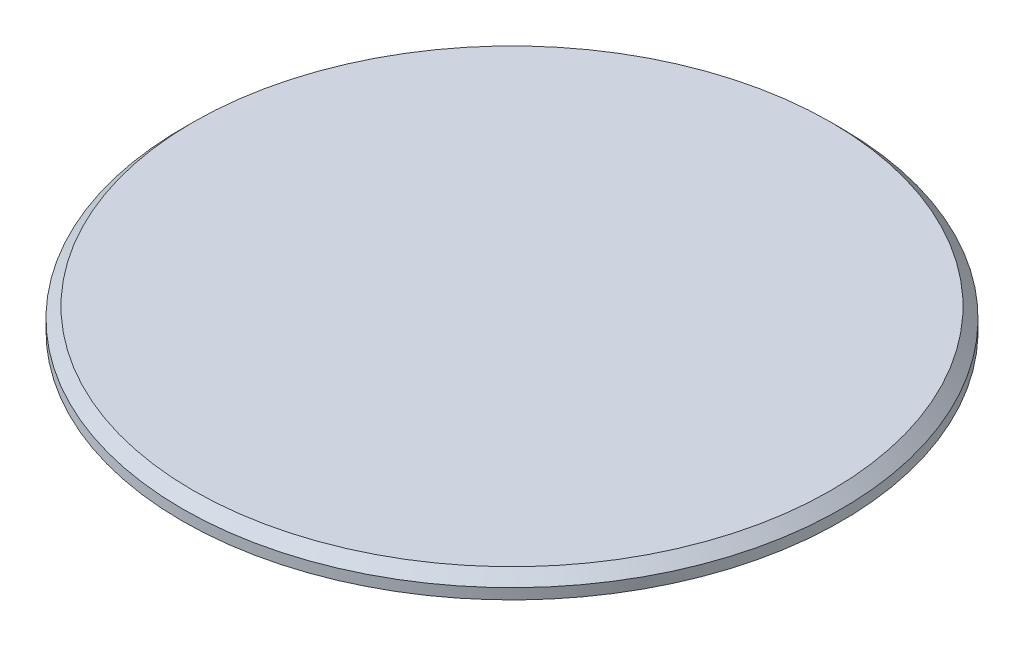
ISO-10303-21;
HEADER;
FILE_DESCRIPTION(('STEP AP214'),'2;1');
FILE_NAME('part.step','',(''),(''),'','','');
FILE_SCHEMA(('AUTOMOTIVE_DESIGN { 1 0 10303 214 1 1 1 1 }'));
ENDSEC;
DATA;
#1=APPLICATION_CONTEXT('core data for automotive mechanical design processes');
#2=APPLICATION_PROTOCOL_DEFINITION('international standard','automotive_design',2000,#1);
#3=PRODUCT_CONTEXT('',#1,'mechanical');
#4=PRODUCT('Part','Part','',(#3));
#5=PRODUCT_RELATED_PRODUCT_CATEGORY('part','',(#4));
#6=PRODUCT_DEFINITION_FORMATION('','',#4);
#7=PRODUCT_DEFINITION_CONTEXT('part definition',#1,'design');
#8=PRODUCT_DEFINITION('design','',#6,#7);
#9=PRODUCT_DEFINITION_SHAPE('','',#8);
#10=(LENGTH_UNIT() NAMED_UNIT(*) SI_UNIT(.MILLI.,.METRE.));
#11=(NAMED_UNIT(*) PLANE_ANGLE_UNIT() SI_UNIT($,.RADIAN.));
#12=(NAMED_UNIT(*) SI_UNIT($,.STERADIAN.) SOLID_ANGLE_UNIT());
#13=UNCERTAINTY_MEASURE_WITH_UNIT(LENGTH_MEASURE(1.E-05),#10,'distance_accuracy_value','');
#14=(GEOMETRIC_REPRESENTATION_CONTEXT(3) GLOBAL_UNCERTAINTY_ASSIGNED_CONTEXT((#13)) GLOBAL_UNIT_ASSIGNED_CONTEXT((#10,
#11,#12)) REPRESENTATION_CONTEXT('',''));
#15=CARTESIAN_POINT('',(0.,0.,0.));
#16=DIRECTION('',(0.,0.,1.));
#17=DIRECTION('',(1.,0.,0.));
#18=AXIS2_PLACEMENT_3D('',#15,#16,#17);
#19=CARTESIAN_POINT('',(0.,7.,0.));
#20=DIRECTION('',(0.,-1.,0.));
#21=DIRECTION('',(0.,0.,-1.));
#22=AXIS2_PLACEMENT_3D('',#19,#20,#21);
#23=CYLINDRICAL_SURFACE('',#22,17.35);
#24=CARTESIAN_POINT('',(0.,7.,0.));
#25=DIRECTION('',(0.,1.,0.));
#26=DIRECTION('',(0.,0.,1.));
#27=AXIS2_PLACEMENT_3D('',#24,#25,#26);
#28=CIRCLE('',#27,17.35);
#29=CARTESIAN_POINT('',(0.,7.,17.35));
#30=VERTEX_POINT('',#29);
#31=EDGE_CURVE('E42',#30,#30,#28,.T.);
#32=ORIENTED_EDGE('',*,*,#31,.F.);
#33=EDGE_LOOP('',(#32));
#34=FACE_BOUND('',#33,.T.);
#35=CARTESIAN_POINT('',(0.,0.,0.));
#36=DIRECTION('',(0.,1.,0.));
#37=DIRECTION('',(0.,0.,1.));
#38=AXIS2_PLACEMENT_3D('',#35,#36,#37);
#39=CIRCLE('',#38,17.35);
#40=CARTESIAN_POINT('',(0.,0.,17.35));
#41=VERTEX_POINT('',#40);
#42=EDGE_CURVE('E46',#41,#41,#39,.T.);
#43=ORIENTED_EDGE('',*,*,#42,.T.);
#44=EDGE_LOOP('',(#43));
#45=FACE_BOUND('',#44,.T.);
#46=ADVANCED_FACE('F31',(#34,#45),#23,.T.);
#47=CARTESIAN_POINT('',(0.,0.,0.));
#48=DIRECTION('',(0.,1.,0.));
#49=DIRECTION('',(0.,0.,1.));
#50=AXIS2_PLACEMENT_3D('',#47,#48,#49);
#51=PLANE('',#50);
#52=CARTESIAN_POINT('',(0.,0.,0.));
#53=DIRECTION('',(0.,-1.,0.));
#54=DIRECTION('',(0.,0.,-1.));
#55=AXIS2_PLACEMENT_3D('',#52,#53,#54);
#56=CIRCLE('',#55,14.6466926588485);
#57=CARTESIAN_POINT('',(0.,0.,-14.6466926588485));
#58=VERTEX_POINT('',#57);
#59=EDGE_CURVE('E55',#58,#58,#56,.T.);
#60=ORIENTED_EDGE('',*,*,#59,.F.);
#61=EDGE_LOOP('',(#60));
#62=FACE_BOUND('',#61,.T.);
#63=ORIENTED_EDGE('',*,*,#42,.F.);
#64=EDGE_LOOP('',(#63));
#65=FACE_BOUND('',#64,.T.);
#66=ADVANCED_FACE('F70',(#62,#65),#51,.F.);
#67=CARTESIAN_POINT('',(0.,7.,0.));
#68=DIRECTION('',(0.,1.,0.));
#69=DIRECTION('',(0.,0.,1.));
#70=AXIS2_PLACEMENT_3D('',#67,#68,#69);
#71=PLANE('',#70);
#72=CARTESIAN_POINT('',(0.,7.,0.));
#73=DIRECTION('',(0.,1.,0.));
#74=DIRECTION('',(0.,0.,1.));
#75=AXIS2_PLACEMENT_3D('',#72,#73,#74);
#76=CIRCLE('',#75,31.);
#77=CARTESIAN_POINT('',(0.,7.,31.));
#78=VERTEX_POINT('',#77);
#79=EDGE_CURVE('E50',#78,#78,#76,.T.);
#80=ORIENTED_EDGE('',*,*,#79,.F.);
#81=EDGE_LOOP('',(#80));
#82=FACE_BOUND('',#81,.T.);
#83=ORIENTED_EDGE('',*,*,#31,.T.);
#84=EDGE_LOOP('',(#83));
#85=FACE_BOUND('',#84,.T.);
#86=ADVANCED_FACE('F73',(#82,#85),#71,.F.);
#87=CARTESIAN_POINT('',(0.,9.,0.));
#88=DIRECTION('',(0.,-1.,0.));
#89=DIRECTION('',(0.,0.,-1.));
#90=AXIS2_PLACEMENT_3D('',#87,#88,#89);
#91=CYLINDRICAL_SURFACE('',#90,31.);
#92=CARTESIAN_POINT('',(0.,8.,0.));
#93=DIRECTION('',(0.,1.,0.));
#94=DIRECTION('',(0.,0.,1.));
#95=AXIS2_PLACEMENT_3D('',#92,#93,#94);
#96=CIRCLE('',#95,31.);
#97=CARTESIAN_POINT('',(0.,8.,31.));
#98=VERTEX_POINT('',#97);
#99=EDGE_CURVE('E10',#98,#98,#96,.F.);
#100=ORIENTED_EDGE('',*,*,#99,.T.);
#101=EDGE_LOOP('',(#100));
#102=FACE_BOUND('',#101,.T.);
#103=ORIENTED_EDGE('',*,*,#79,.T.);
#104=EDGE_LOOP('',(#103));
#105=FACE_BOUND('',#104,.T.);
#106=ADVANCED_FACE('F83',(#102,#105),#91,.T.);
#107=CARTESIAN_POINT('',(0.,9.,0.));
#108=DIRECTION('',(0.,1.,0.));
#109=DIRECTION('',(0.,0.,1.));
#110=AXIS2_PLACEMENT_3D('',#107,#108,#109);
#111=PLANE('',#110);
#112=CARTESIAN_POINT('',(0.,9.,0.));
#113=DIRECTION('',(0.,1.,0.));
#114=DIRECTION('',(0.,0.,1.));
#115=AXIS2_PLACEMENT_3D('',#112,#113,#114);
#116=CIRCLE('',#115,30.);
#117=CARTESIAN_POINT('',(0.,9.,30.));
#118=VERTEX_POINT('',#117);
#119=EDGE_CURVE('E38',#118,#118,#116,.T.);
#120=ORIENTED_EDGE('',*,*,#119,.T.);
#121=EDGE_LOOP('',(#120));
#122=FACE_BOUND('',#121,.T.);
#123=ADVANCED_FACE('F66',(#122),#111,.T.);
#124=CARTESIAN_POINT('',(0.,7.,0.));
#125=DIRECTION('',(0.,-1.,0.));
#126=DIRECTION('',(0.,0.,-1.));
#127=AXIS2_PLACEMENT_3D('',#124,#125,#126);
#128=CYLINDRICAL_SURFACE('',#127,14.6466926588485);
#129=CARTESIAN_POINT('',(0.,7.,0.));
#130=DIRECTION('',(0.,-1.,0.));
#131=DIRECTION('',(0.,0.,-1.));
#132=AXIS2_PLACEMENT_3D('',#129,#130,#131);
#133=CIRCLE('',#132,14.6466926588485);
#134=CARTESIAN_POINT('',(0.,7.,-14.6466926588485));
#135=VERTEX_POINT('',#134);
#136=EDGE_CURVE('E54',#135,#135,#133,.T.);
#137=ORIENTED_EDGE('',*,*,#136,.F.);
#138=EDGE_LOOP('',(#137));
#139=FACE_BOUND('',#138,.T.);
#140=ORIENTED_EDGE('',*,*,#59,.T.);
#141=EDGE_LOOP('',(#140));
#142=FACE_BOUND('',#141,.T.);
#143=ADVANCED_FACE('F63',(#139,#142),#128,.F.);
#144=CARTESIAN_POINT('',(0.,7.,0.));
#145=DIRECTION('',(0.,-1.,0.));
#146=DIRECTION('',(0.,0.,-1.));
#147=AXIS2_PLACEMENT_3D('',#144,#145,#146);
#148=PLANE('',#147);
#149=ORIENTED_EDGE('',*,*,#136,.T.);
#150=EDGE_LOOP('',(#149));
#151=FACE_BOUND('',#150,.T.);
#152=ADVANCED_FACE('F61',(#151),#148,.T.);
#153=CARTESIAN_POINT('',(0.,9.,0.));
#154=DIRECTION('',(0.,-1.,0.));
#155=DIRECTION('',(0.,0.,-1.));
#156=AXIS2_PLACEMENT_3D('',#153,#154,#155);
#157=CONICAL_SURFACE('',#156,30.,0.78539816339745);
#158=ORIENTED_EDGE('',*,*,#99,.F.);
#159=EDGE_LOOP('',(#158));
#160=FACE_BOUND('',#159,.T.);
#161=ORIENTED_EDGE('',*,*,#119,.F.);
#162=EDGE_LOOP('',(#161));
#163=FACE_BOUND('',#162,.T.);
#164=ADVANCED_FACE('F33',(#160,#163),#157,.T.);
#165=CLOSED_SHELL('',(#46,#66,#86,#106,#123,#143,#152,#164));
#166=MANIFOLD_SOLID_BREP('B2',#165);
#167=ADVANCED_BREP_SHAPE_REPRESENTATION('',(#18,#166),#14);
#168=SHAPE_DEFINITION_REPRESENTATION(#9,#167);
ENDSEC;
END-ISO-10303-21;
